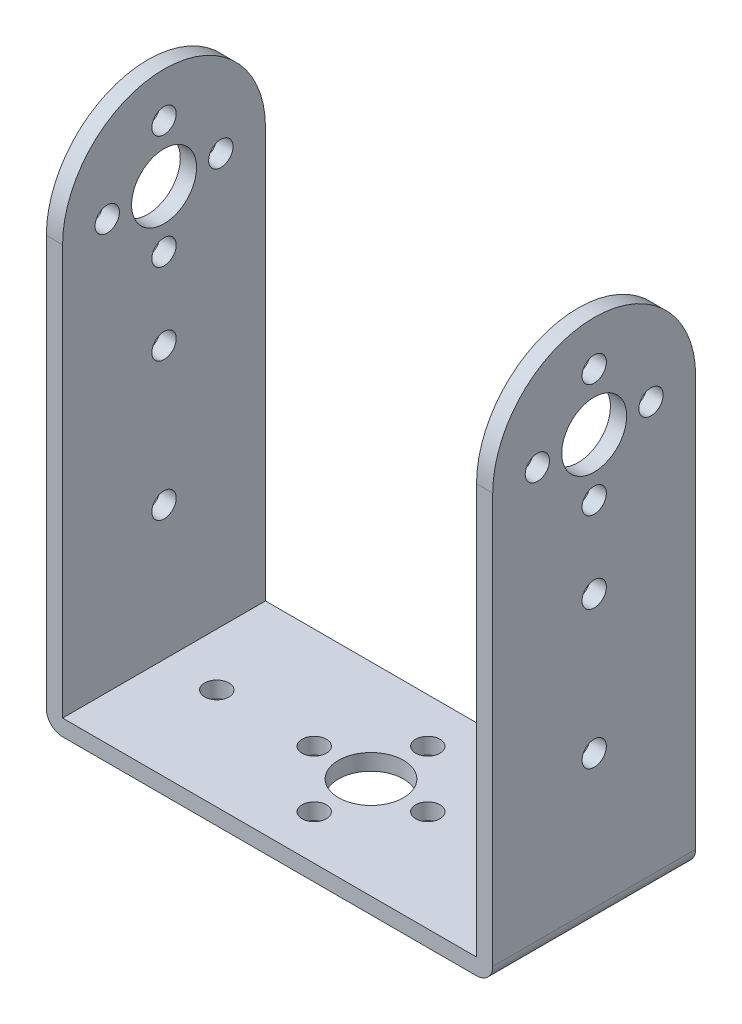
ISO-10303-21;
HEADER;
FILE_DESCRIPTION(('STEP AP214'),'2;1');
FILE_NAME('part.step','',(''),(''),'','','');
FILE_SCHEMA(('AUTOMOTIVE_DESIGN { 1 0 10303 214 1 1 1 1 }'));
ENDSEC;
DATA;
#1=APPLICATION_CONTEXT('core data for automotive mechanical design processes');
#2=APPLICATION_PROTOCOL_DEFINITION('international standard','automotive_design',2000,#1);
#3=PRODUCT_CONTEXT('',#1,'mechanical');
#4=PRODUCT('Part','Part','',(#3));
#5=PRODUCT_RELATED_PRODUCT_CATEGORY('part','',(#4));
#6=PRODUCT_DEFINITION_FORMATION('','',#4);
#7=PRODUCT_DEFINITION_CONTEXT('part definition',#1,'design');
#8=PRODUCT_DEFINITION('design','',#6,#7);
#9=PRODUCT_DEFINITION_SHAPE('','',#8);
#10=(LENGTH_UNIT() NAMED_UNIT(*) SI_UNIT(.MILLI.,.METRE.));
#11=(NAMED_UNIT(*) PLANE_ANGLE_UNIT() SI_UNIT($,.RADIAN.));
#12=(NAMED_UNIT(*) SI_UNIT($,.STERADIAN.) SOLID_ANGLE_UNIT());
#13=UNCERTAINTY_MEASURE_WITH_UNIT(LENGTH_MEASURE(1.E-05),#10,'distance_accuracy_value','');
#14=(GEOMETRIC_REPRESENTATION_CONTEXT(3) GLOBAL_UNCERTAINTY_ASSIGNED_CONTEXT((#13)) GLOBAL_UNIT_ASSIGNED_CONTEXT((#10,
#11,#12)) REPRESENTATION_CONTEXT('',''));
#15=CARTESIAN_POINT('',(0.,0.,0.));
#16=DIRECTION('',(0.,0.,1.));
#17=DIRECTION('',(1.,0.,0.));
#18=AXIS2_PLACEMENT_3D('',#15,#16,#17);
#19=CARTESIAN_POINT('',(-48.7225202501066,30.4955947136564,25.));
#20=DIRECTION('',(1.,0.,0.));
#21=DIRECTION('',(0.,1.,0.));
#22=AXIS2_PLACEMENT_3D('',#19,#20,#21);
#23=PLANE('',#22);
#24=CARTESIAN_POINT('',(-48.7225202501066,17.9955947136564,19.5));
#25=DIRECTION('',(1.,0.,0.));
#26=DIRECTION('',(0.,1.,0.));
#27=AXIS2_PLACEMENT_3D('',#24,#25,#26);
#28=CIRCLE('',#27,1.5);
#29=CARTESIAN_POINT('',(-48.7225202501066,19.4955947136564,19.5));
#30=VERTEX_POINT('',#29);
#31=EDGE_CURVE('E255',#30,#30,#28,.T.);
#32=ORIENTED_EDGE('',*,*,#31,.T.);
#33=EDGE_LOOP('',(#32));
#34=FACE_BOUND('',#33,.T.);
#35=CARTESIAN_POINT('',(-48.7225202501066,10.9955947136564,12.5));
#36=DIRECTION('',(1.,0.,0.));
#37=DIRECTION('',(0.,1.,0.));
#38=AXIS2_PLACEMENT_3D('',#35,#36,#37);
#39=CIRCLE('',#38,1.5);
#40=CARTESIAN_POINT('',(-48.7225202501066,12.4955947136564,12.5));
#41=VERTEX_POINT('',#40);
#42=EDGE_CURVE('E515',#41,#41,#39,.T.);
#43=ORIENTED_EDGE('',*,*,#42,.T.);
#44=EDGE_LOOP('',(#43));
#45=FACE_BOUND('',#44,.T.);
#46=CARTESIAN_POINT('',(-48.7225202501066,17.9955947136564,5.50000000000001));
#47=DIRECTION('',(1.,0.,0.));
#48=DIRECTION('',(0.,1.,0.));
#49=AXIS2_PLACEMENT_3D('',#46,#47,#48);
#50=CIRCLE('',#49,1.5);
#51=CARTESIAN_POINT('',(-48.7225202501066,19.4955947136564,5.50000000000001));
#52=VERTEX_POINT('',#51);
#53=EDGE_CURVE('E510',#52,#52,#50,.T.);
#54=ORIENTED_EDGE('',*,*,#53,.T.);
#55=EDGE_LOOP('',(#54));
#56=FACE_BOUND('',#55,.T.);
#57=CARTESIAN_POINT('',(-48.7225202501066,24.9955947136564,12.5));
#58=DIRECTION('',(1.,0.,0.));
#59=DIRECTION('',(0.,1.,0.));
#60=AXIS2_PLACEMENT_3D('',#57,#58,#59);
#61=CIRCLE('',#60,1.5);
#62=CARTESIAN_POINT('',(-48.7225202501066,26.4955947136564,12.5));
#63=VERTEX_POINT('',#62);
#64=EDGE_CURVE('E514',#63,#63,#61,.T.);
#65=ORIENTED_EDGE('',*,*,#64,.T.);
#66=EDGE_LOOP('',(#65));
#67=FACE_BOUND('',#66,.T.);
#68=CARTESIAN_POINT('',(-48.7225202501066,17.9955947136564,12.5));
#69=DIRECTION('',(1.,0.,0.));
#70=DIRECTION('',(0.,1.,0.));
#71=AXIS2_PLACEMENT_3D('',#68,#69,#70);
#72=CIRCLE('',#71,4.);
#73=CARTESIAN_POINT('',(-48.7225202501066,21.9955947136564,12.5));
#74=VERTEX_POINT('',#73);
#75=EDGE_CURVE('E509',#74,#74,#72,.T.);
#76=ORIENTED_EDGE('',*,*,#75,.T.);
#77=EDGE_LOOP('',(#76));
#78=FACE_BOUND('',#77,.T.);
#79=CARTESIAN_POINT('',(-48.7225202501066,0.995594713656392,12.5));
#80=DIRECTION('',(1.,0.,0.));
#81=DIRECTION('',(0.,1.,0.));
#82=AXIS2_PLACEMENT_3D('',#79,#80,#81);
#83=CIRCLE('',#82,1.5);
#84=CARTESIAN_POINT('',(-48.7225202501066,2.49559471365639,12.5));
#85=VERTEX_POINT('',#84);
#86=EDGE_CURVE('E519',#85,#85,#83,.T.);
#87=ORIENTED_EDGE('',*,*,#86,.T.);
#88=EDGE_LOOP('',(#87));
#89=FACE_BOUND('',#88,.T.);
#90=CARTESIAN_POINT('',(-48.7225202501066,-16.0044052863436,12.5));
#91=DIRECTION('',(1.,0.,0.));
#92=DIRECTION('',(0.,1.,0.));
#93=AXIS2_PLACEMENT_3D('',#90,#91,#92);
#94=CIRCLE('',#93,1.5);
#95=CARTESIAN_POINT('',(-48.7225202501066,-14.5044052863436,12.5));
#96=VERTEX_POINT('',#95);
#97=EDGE_CURVE('E458',#96,#96,#94,.T.);
#98=ORIENTED_EDGE('',*,*,#97,.T.);
#99=EDGE_LOOP('',(#98));
#100=FACE_BOUND('',#99,.T.);
#101=DIRECTION('',(0.,-1.,0.));
#102=VECTOR('',#101,1.);
#103=CARTESIAN_POINT('',(-48.7225202501066,30.4955947136564,25.));
#104=LINE('',#103,#102);
#105=CARTESIAN_POINT('',(-48.7225202501066,17.9955947136564,25.));
#106=VERTEX_POINT('',#105);
#107=CARTESIAN_POINT('',(-48.7225202501066,-32.5044052863436,25.));
#108=VERTEX_POINT('',#107);
#109=EDGE_CURVE('E185',#106,#108,#104,.T.);
#110=ORIENTED_EDGE('',*,*,#109,.F.);
#111=CARTESIAN_POINT('',(-48.7225202501066,17.9955947136564,12.5));
#112=DIRECTION('',(1.,0.,0.));
#113=DIRECTION('',(0.,1.,0.));
#114=AXIS2_PLACEMENT_3D('',#111,#112,#113);
#115=CIRCLE('',#114,12.5);
#116=CARTESIAN_POINT('',(-48.7225202501066,17.9955947136564,0.));
#117=VERTEX_POINT('',#116);
#118=EDGE_CURVE('E153',#117,#106,#115,.T.);
#119=ORIENTED_EDGE('',*,*,#118,.F.);
#120=DIRECTION('',(0.,-1.,0.));
#121=VECTOR('',#120,1.);
#122=CARTESIAN_POINT('',(-48.7225202501066,30.4955947136564,0.));
#123=LINE('',#122,#121);
#124=CARTESIAN_POINT('',(-48.7225202501066,-32.5044052863436,0.));
#125=VERTEX_POINT('',#124);
#126=EDGE_CURVE('E166',#117,#125,#123,.T.);
#127=ORIENTED_EDGE('',*,*,#126,.T.);
#128=DIRECTION('',(0.,0.,-1.));
#129=VECTOR('',#128,1.);
#130=CARTESIAN_POINT('',(-48.7225202501066,-32.5044052863436,25.));
#131=LINE('',#130,#129);
#132=EDGE_CURVE('E241',#125,#108,#131,.F.);
#133=ORIENTED_EDGE('',*,*,#132,.T.);
#134=EDGE_LOOP('',(#110,#119,#127,#133));
#135=FACE_BOUND('',#134,.T.);
#136=ADVANCED_FACE('F78',(#34,#45,#56,#67,#78,#89,#100,#135),#23,.F.);
#137=CARTESIAN_POINT('',(6.27747974989341,-34.5044052863436,25.));
#138=DIRECTION('',(-1.,0.,0.));
#139=DIRECTION('',(0.,-1.,0.));
#140=AXIS2_PLACEMENT_3D('',#137,#138,#139);
#141=PLANE('',#140);
#142=CARTESIAN_POINT('',(6.27747974989341,17.9955947136564,19.5));
#143=DIRECTION('',(-1.,0.,0.));
#144=DIRECTION('',(0.,-1.,0.));
#145=AXIS2_PLACEMENT_3D('',#142,#143,#144);
#146=CIRCLE('',#145,1.5);
#147=CARTESIAN_POINT('',(6.27747974989341,16.4955947136564,19.5));
#148=VERTEX_POINT('',#147);
#149=EDGE_CURVE('E307',#148,#148,#146,.T.);
#150=ORIENTED_EDGE('',*,*,#149,.T.);
#151=EDGE_LOOP('',(#150));
#152=FACE_BOUND('',#151,.T.);
#153=CARTESIAN_POINT('',(6.27747974989341,10.9955947136564,12.5));
#154=DIRECTION('',(-1.,0.,0.));
#155=DIRECTION('',(0.,-1.,0.));
#156=AXIS2_PLACEMENT_3D('',#153,#154,#155);
#157=CIRCLE('',#156,1.5);
#158=CARTESIAN_POINT('',(6.27747974989341,9.49559471365639,12.5));
#159=VERTEX_POINT('',#158);
#160=EDGE_CURVE('E289',#159,#159,#157,.T.);
#161=ORIENTED_EDGE('',*,*,#160,.T.);
#162=EDGE_LOOP('',(#161));
#163=FACE_BOUND('',#162,.T.);
#164=CARTESIAN_POINT('',(6.27747974989341,17.9955947136564,5.50000000000001));
#165=DIRECTION('',(-1.,0.,0.));
#166=DIRECTION('',(0.,-1.,0.));
#167=AXIS2_PLACEMENT_3D('',#164,#165,#166);
#168=CIRCLE('',#167,1.5);
#169=CARTESIAN_POINT('',(6.27747974989341,16.4955947136564,5.50000000000001));
#170=VERTEX_POINT('',#169);
#171=EDGE_CURVE('E283',#170,#170,#168,.T.);
#172=ORIENTED_EDGE('',*,*,#171,.T.);
#173=EDGE_LOOP('',(#172));
#174=FACE_BOUND('',#173,.T.);
#175=CARTESIAN_POINT('',(6.27747974989341,24.9955947136564,12.5));
#176=DIRECTION('',(-1.,0.,0.));
#177=DIRECTION('',(0.,-1.,0.));
#178=AXIS2_PLACEMENT_3D('',#175,#176,#177);
#179=CIRCLE('',#178,1.5);
#180=CARTESIAN_POINT('',(6.27747974989341,23.4955947136564,12.5));
#181=VERTEX_POINT('',#180);
#182=EDGE_CURVE('E278',#181,#181,#179,.T.);
#183=ORIENTED_EDGE('',*,*,#182,.T.);
#184=EDGE_LOOP('',(#183));
#185=FACE_BOUND('',#184,.T.);
#186=CARTESIAN_POINT('',(6.27747974989341,17.9955947136564,12.5));
#187=DIRECTION('',(-1.,0.,0.));
#188=DIRECTION('',(0.,-1.,0.));
#189=AXIS2_PLACEMENT_3D('',#186,#187,#188);
#190=CIRCLE('',#189,4.);
#191=CARTESIAN_POINT('',(6.27747974989341,13.9955947136564,12.5));
#192=VERTEX_POINT('',#191);
#193=EDGE_CURVE('E273',#192,#192,#190,.T.);
#194=ORIENTED_EDGE('',*,*,#193,.T.);
#195=EDGE_LOOP('',(#194));
#196=FACE_BOUND('',#195,.T.);
#197=CARTESIAN_POINT('',(6.27747974989341,0.995594713656386,12.5));
#198=DIRECTION('',(-1.,0.,0.));
#199=DIRECTION('',(0.,-1.,0.));
#200=AXIS2_PLACEMENT_3D('',#197,#198,#199);
#201=CIRCLE('',#200,1.5);
#202=CARTESIAN_POINT('',(6.27747974989341,-0.504405286343615,12.5));
#203=VERTEX_POINT('',#202);
#204=EDGE_CURVE('E267',#203,#203,#201,.T.);
#205=ORIENTED_EDGE('',*,*,#204,.T.);
#206=EDGE_LOOP('',(#205));
#207=FACE_BOUND('',#206,.T.);
#208=CARTESIAN_POINT('',(6.27747974989341,-16.0044052863436,12.5));
#209=DIRECTION('',(-1.,0.,0.));
#210=DIRECTION('',(0.,-1.,0.));
#211=AXIS2_PLACEMENT_3D('',#208,#209,#210);
#212=CIRCLE('',#211,1.5);
#213=CARTESIAN_POINT('',(6.27747974989341,-17.5044052863436,12.5));
#214=VERTEX_POINT('',#213);
#215=EDGE_CURVE('E261',#214,#214,#212,.T.);
#216=ORIENTED_EDGE('',*,*,#215,.T.);
#217=EDGE_LOOP('',(#216));
#218=FACE_BOUND('',#217,.T.);
#219=CARTESIAN_POINT('',(6.27747974989341,17.9955947136564,12.5));
#220=DIRECTION('',(1.,0.,0.));
#221=DIRECTION('',(0.,1.,0.));
#222=AXIS2_PLACEMENT_3D('',#219,#220,#221);
#223=CIRCLE('',#222,12.5);
#224=CARTESIAN_POINT('',(6.27747974989341,17.9955947136564,0.));
#225=VERTEX_POINT('',#224);
#226=CARTESIAN_POINT('',(6.27747974989341,17.9955947136564,25.));
#227=VERTEX_POINT('',#226);
#228=EDGE_CURVE('E96',#225,#227,#223,.T.);
#229=ORIENTED_EDGE('',*,*,#228,.T.);
#230=DIRECTION('',(0.,1.,0.));
#231=VECTOR('',#230,1.);
#232=CARTESIAN_POINT('',(6.27747974989341,-34.5044052863436,25.));
#233=LINE('',#232,#231);
#234=CARTESIAN_POINT('',(6.27747974989341,-32.5044052863436,25.));
#235=VERTEX_POINT('',#234);
#236=EDGE_CURVE('E161',#235,#227,#233,.T.);
#237=ORIENTED_EDGE('',*,*,#236,.F.);
#238=DIRECTION('',(0.,0.,-1.));
#239=VECTOR('',#238,1.);
#240=CARTESIAN_POINT('',(6.27747974989341,-32.5044052863436,25.));
#241=LINE('',#240,#239);
#242=CARTESIAN_POINT('',(6.27747974989341,-32.5044052863436,0.));
#243=VERTEX_POINT('',#242);
#244=EDGE_CURVE('E220',#235,#243,#241,.T.);
#245=ORIENTED_EDGE('',*,*,#244,.T.);
#246=DIRECTION('',(0.,1.,0.));
#247=VECTOR('',#246,1.);
#248=CARTESIAN_POINT('',(6.27747974989341,-34.5044052863436,0.));
#249=LINE('',#248,#247);
#250=EDGE_CURVE('E164',#243,#225,#249,.T.);
#251=ORIENTED_EDGE('',*,*,#250,.T.);
#252=EDGE_LOOP('',(#229,#237,#245,#251));
#253=FACE_BOUND('',#252,.T.);
#254=ADVANCED_FACE('F158',(#152,#163,#174,#185,#196,#207,#218,#253),#141,.F.);
#255=CARTESIAN_POINT('',(4.2774797498934,30.4955947136564,25.));
#256=DIRECTION('',(1.,0.,0.));
#257=DIRECTION('',(0.,1.,0.));
#258=AXIS2_PLACEMENT_3D('',#255,#256,#257);
#259=PLANE('',#258);
#260=CARTESIAN_POINT('',(4.2774797498934,17.9955947136564,19.5));
#261=DIRECTION('',(1.,0.,0.));
#262=DIRECTION('',(0.,1.,0.));
#263=AXIS2_PLACEMENT_3D('',#260,#261,#262);
#264=CIRCLE('',#263,1.5);
#265=CARTESIAN_POINT('',(4.2774797498934,19.4955947136564,19.5));
#266=VERTEX_POINT('',#265);
#267=EDGE_CURVE('E303',#266,#266,#264,.T.);
#268=ORIENTED_EDGE('',*,*,#267,.T.);
#269=EDGE_LOOP('',(#268));
#270=FACE_BOUND('',#269,.T.);
#271=CARTESIAN_POINT('',(4.2774797498934,10.9955947136564,12.5));
#272=DIRECTION('',(1.,0.,0.));
#273=DIRECTION('',(0.,1.,0.));
#274=AXIS2_PLACEMENT_3D('',#271,#272,#273);
#275=CIRCLE('',#274,1.5);
#276=CARTESIAN_POINT('',(4.2774797498934,12.4955947136564,12.5));
#277=VERTEX_POINT('',#276);
#278=EDGE_CURVE('E282',#277,#277,#275,.T.);
#279=ORIENTED_EDGE('',*,*,#278,.T.);
#280=EDGE_LOOP('',(#279));
#281=FACE_BOUND('',#280,.T.);
#282=CARTESIAN_POINT('',(4.2774797498934,17.9955947136564,5.50000000000001));
#283=DIRECTION('',(1.,0.,0.));
#284=DIRECTION('',(0.,1.,0.));
#285=AXIS2_PLACEMENT_3D('',#282,#283,#284);
#286=CIRCLE('',#285,1.5);
#287=CARTESIAN_POINT('',(4.2774797498934,19.4955947136564,5.50000000000001));
#288=VERTEX_POINT('',#287);
#289=EDGE_CURVE('E277',#288,#288,#286,.T.);
#290=ORIENTED_EDGE('',*,*,#289,.T.);
#291=EDGE_LOOP('',(#290));
#292=FACE_BOUND('',#291,.T.);
#293=CARTESIAN_POINT('',(4.2774797498934,24.9955947136564,12.5));
#294=DIRECTION('',(1.,0.,0.));
#295=DIRECTION('',(0.,1.,0.));
#296=AXIS2_PLACEMENT_3D('',#293,#294,#295);
#297=CIRCLE('',#296,1.5);
#298=CARTESIAN_POINT('',(4.2774797498934,26.4955947136564,12.5));
#299=VERTEX_POINT('',#298);
#300=EDGE_CURVE('E272',#299,#299,#297,.T.);
#301=ORIENTED_EDGE('',*,*,#300,.T.);
#302=EDGE_LOOP('',(#301));
#303=FACE_BOUND('',#302,.T.);
#304=CARTESIAN_POINT('',(4.2774797498934,17.9955947136564,12.5));
#305=DIRECTION('',(1.,0.,0.));
#306=DIRECTION('',(0.,1.,0.));
#307=AXIS2_PLACEMENT_3D('',#304,#305,#306);
#308=CIRCLE('',#307,4.);
#309=CARTESIAN_POINT('',(4.2774797498934,21.9955947136564,12.5));
#310=VERTEX_POINT('',#309);
#311=EDGE_CURVE('E266',#310,#310,#308,.T.);
#312=ORIENTED_EDGE('',*,*,#311,.T.);
#313=EDGE_LOOP('',(#312));
#314=FACE_BOUND('',#313,.T.);
#315=CARTESIAN_POINT('',(4.27747974989341,0.995594713656386,12.5));
#316=DIRECTION('',(1.,0.,0.));
#317=DIRECTION('',(0.,1.,0.));
#318=AXIS2_PLACEMENT_3D('',#315,#316,#317);
#319=CIRCLE('',#318,1.5);
#320=CARTESIAN_POINT('',(4.27747974989341,2.49559471365639,12.5));
#321=VERTEX_POINT('',#320);
#322=EDGE_CURVE('E260',#321,#321,#319,.T.);
#323=ORIENTED_EDGE('',*,*,#322,.T.);
#324=EDGE_LOOP('',(#323));
#325=FACE_BOUND('',#324,.T.);
#326=CARTESIAN_POINT('',(4.27747974989341,-16.0044052863436,12.5));
#327=DIRECTION('',(1.,0.,0.));
#328=DIRECTION('',(0.,1.,0.));
#329=AXIS2_PLACEMENT_3D('',#326,#327,#328);
#330=CIRCLE('',#329,1.5);
#331=CARTESIAN_POINT('',(4.27747974989341,-14.5044052863436,12.5));
#332=VERTEX_POINT('',#331);
#333=EDGE_CURVE('E254',#332,#332,#330,.T.);
#334=ORIENTED_EDGE('',*,*,#333,.T.);
#335=EDGE_LOOP('',(#334));
#336=FACE_BOUND('',#335,.T.);
#337=DIRECTION('',(0.,-1.,0.));
#338=VECTOR('',#337,1.);
#339=CARTESIAN_POINT('',(4.2774797498934,30.4955947136564,25.));
#340=LINE('',#339,#338);
#341=CARTESIAN_POINT('',(4.27747974989341,17.9955947136564,25.));
#342=VERTEX_POINT('',#341);
#343=CARTESIAN_POINT('',(4.27747974989341,-32.5044052863436,25.));
#344=VERTEX_POINT('',#343);
#345=EDGE_CURVE('E178',#342,#344,#340,.T.);
#346=ORIENTED_EDGE('',*,*,#345,.F.);
#347=CARTESIAN_POINT('',(4.2774797498934,17.9955947136564,12.5));
#348=DIRECTION('',(1.,0.,0.));
#349=DIRECTION('',(0.,1.,0.));
#350=AXIS2_PLACEMENT_3D('',#347,#348,#349);
#351=CIRCLE('',#350,12.5);
#352=CARTESIAN_POINT('',(4.27747974989341,17.9955947136564,0.));
#353=VERTEX_POINT('',#352);
#354=EDGE_CURVE('E167',#353,#342,#351,.T.);
#355=ORIENTED_EDGE('',*,*,#354,.F.);
#356=DIRECTION('',(0.,-1.,0.));
#357=VECTOR('',#356,1.);
#358=CARTESIAN_POINT('',(4.2774797498934,30.4955947136564,0.));
#359=LINE('',#358,#357);
#360=CARTESIAN_POINT('',(4.27747974989341,-32.5044052863436,0.));
#361=VERTEX_POINT('',#360);
#362=EDGE_CURVE('E203',#353,#361,#359,.T.);
#363=ORIENTED_EDGE('',*,*,#362,.T.);
#364=DIRECTION('',(0.,0.,-1.));
#365=VECTOR('',#364,1.);
#366=CARTESIAN_POINT('',(4.27747974989341,-32.5044052863436,25.));
#367=LINE('',#366,#365);
#368=EDGE_CURVE('E216',#344,#361,#367,.T.);
#369=ORIENTED_EDGE('',*,*,#368,.F.);
#370=EDGE_LOOP('',(#346,#355,#363,#369));
#371=FACE_BOUND('',#370,.T.);
#372=ADVANCED_FACE('F357',(#270,#281,#292,#303,#314,#325,#336,#371),#259,.F.);
#373=CARTESIAN_POINT('',(-46.7225202501066,-32.5044052863436,25.));
#374=DIRECTION('',(-1.,0.,0.));
#375=DIRECTION('',(0.,-1.,0.));
#376=AXIS2_PLACEMENT_3D('',#373,#374,#375);
#377=PLANE('',#376);
#378=CARTESIAN_POINT('',(-46.7225202501066,17.9955947136564,19.5));
#379=DIRECTION('',(-1.,0.,0.));
#380=DIRECTION('',(0.,-1.,0.));
#381=AXIS2_PLACEMENT_3D('',#378,#379,#380);
#382=CIRCLE('',#381,1.5);
#383=CARTESIAN_POINT('',(-46.7225202501066,16.4955947136564,19.5));
#384=VERTEX_POINT('',#383);
#385=EDGE_CURVE('E82',#384,#384,#382,.T.);
#386=ORIENTED_EDGE('',*,*,#385,.T.);
#387=EDGE_LOOP('',(#386));
#388=FACE_BOUND('',#387,.T.);
#389=CARTESIAN_POINT('',(-46.7225202501066,10.9955947136564,12.5));
#390=DIRECTION('',(-1.,0.,0.));
#391=DIRECTION('',(0.,-1.,0.));
#392=AXIS2_PLACEMENT_3D('',#389,#390,#391);
#393=CIRCLE('',#392,1.5);
#394=CARTESIAN_POINT('',(-46.7225202501066,9.49559471365639,12.5));
#395=VERTEX_POINT('',#394);
#396=EDGE_CURVE('E279',#395,#395,#393,.T.);
#397=ORIENTED_EDGE('',*,*,#396,.T.);
#398=EDGE_LOOP('',(#397));
#399=FACE_BOUND('',#398,.T.);
#400=CARTESIAN_POINT('',(-46.7225202501066,17.9955947136564,5.50000000000001));
#401=DIRECTION('',(-1.,0.,0.));
#402=DIRECTION('',(0.,-1.,0.));
#403=AXIS2_PLACEMENT_3D('',#400,#401,#402);
#404=CIRCLE('',#403,1.5);
#405=CARTESIAN_POINT('',(-46.7225202501066,16.4955947136564,5.50000000000001));
#406=VERTEX_POINT('',#405);
#407=EDGE_CURVE('E274',#406,#406,#404,.T.);
#408=ORIENTED_EDGE('',*,*,#407,.T.);
#409=EDGE_LOOP('',(#408));
#410=FACE_BOUND('',#409,.T.);
#411=CARTESIAN_POINT('',(-46.7225202501066,24.9955947136564,12.5));
#412=DIRECTION('',(-1.,0.,0.));
#413=DIRECTION('',(0.,-1.,0.));
#414=AXIS2_PLACEMENT_3D('',#411,#412,#413);
#415=CIRCLE('',#414,1.5);
#416=CARTESIAN_POINT('',(-46.7225202501066,23.4955947136564,12.5));
#417=VERTEX_POINT('',#416);
#418=EDGE_CURVE('E268',#417,#417,#415,.T.);
#419=ORIENTED_EDGE('',*,*,#418,.T.);
#420=EDGE_LOOP('',(#419));
#421=FACE_BOUND('',#420,.T.);
#422=CARTESIAN_POINT('',(-46.7225202501066,17.9955947136564,12.5));
#423=DIRECTION('',(-1.,0.,0.));
#424=DIRECTION('',(0.,-1.,0.));
#425=AXIS2_PLACEMENT_3D('',#422,#423,#424);
#426=CIRCLE('',#425,4.);
#427=CARTESIAN_POINT('',(-46.7225202501066,13.9955947136564,12.5));
#428=VERTEX_POINT('',#427);
#429=EDGE_CURVE('E262',#428,#428,#426,.T.);
#430=ORIENTED_EDGE('',*,*,#429,.T.);
#431=EDGE_LOOP('',(#430));
#432=FACE_BOUND('',#431,.T.);
#433=CARTESIAN_POINT('',(-46.7225202501066,0.995594713656391,12.5));
#434=DIRECTION('',(-1.,0.,0.));
#435=DIRECTION('',(0.,-1.,0.));
#436=AXIS2_PLACEMENT_3D('',#433,#434,#435);
#437=CIRCLE('',#436,1.5);
#438=CARTESIAN_POINT('',(-46.7225202501066,-0.504405286343609,12.5));
#439=VERTEX_POINT('',#438);
#440=EDGE_CURVE('E256',#439,#439,#437,.T.);
#441=ORIENTED_EDGE('',*,*,#440,.T.);
#442=EDGE_LOOP('',(#441));
#443=FACE_BOUND('',#442,.T.);
#444=CARTESIAN_POINT('',(-46.7225202501066,-16.0044052863436,12.5));
#445=DIRECTION('',(-1.,0.,0.));
#446=DIRECTION('',(0.,-1.,0.));
#447=AXIS2_PLACEMENT_3D('',#444,#445,#446);
#448=CIRCLE('',#447,1.5);
#449=CARTESIAN_POINT('',(-46.7225202501066,-17.5044052863436,12.5));
#450=VERTEX_POINT('',#449);
#451=EDGE_CURVE('E250',#450,#450,#448,.T.);
#452=ORIENTED_EDGE('',*,*,#451,.T.);
#453=EDGE_LOOP('',(#452));
#454=FACE_BOUND('',#453,.T.);
#455=CARTESIAN_POINT('',(-46.7225202501066,17.9955947136564,12.5));
#456=DIRECTION('',(-1.,0.,0.));
#457=DIRECTION('',(0.,-1.,0.));
#458=AXIS2_PLACEMENT_3D('',#455,#456,#457);
#459=CIRCLE('',#458,12.5);
#460=CARTESIAN_POINT('',(-46.7225202501066,17.9955947136564,25.));
#461=VERTEX_POINT('',#460);
#462=CARTESIAN_POINT('',(-46.7225202501066,17.9955947136564,0.));
#463=VERTEX_POINT('',#462);
#464=EDGE_CURVE('E322',#461,#463,#459,.T.);
#465=ORIENTED_EDGE('',*,*,#464,.F.);
#466=DIRECTION('',(0.,1.,0.));
#467=VECTOR('',#466,1.);
#468=CARTESIAN_POINT('',(-46.7225202501066,-32.5044052863436,25.));
#469=LINE('',#468,#467);
#470=CARTESIAN_POINT('',(-46.7225202501066,-32.5044052863436,25.));
#471=VERTEX_POINT('',#470);
#472=EDGE_CURVE('E191',#471,#461,#469,.T.);
#473=ORIENTED_EDGE('',*,*,#472,.F.);
#474=DIRECTION('',(0.,0.,-1.));
#475=VECTOR('',#474,1.);
#476=CARTESIAN_POINT('',(-46.7225202501066,-32.5044052863436,25.));
#477=LINE('',#476,#475);
#478=CARTESIAN_POINT('',(-46.7225202501066,-32.5044052863436,0.));
#479=VERTEX_POINT('',#478);
#480=EDGE_CURVE('E195',#471,#479,#477,.T.);
#481=ORIENTED_EDGE('',*,*,#480,.T.);
#482=DIRECTION('',(0.,1.,0.));
#483=VECTOR('',#482,1.);
#484=CARTESIAN_POINT('',(-46.7225202501066,-32.5044052863436,0.));
#485=LINE('',#484,#483);
#486=EDGE_CURVE('E209',#479,#463,#485,.T.);
#487=ORIENTED_EDGE('',*,*,#486,.T.);
#488=EDGE_LOOP('',(#465,#473,#481,#487));
#489=FACE_BOUND('',#488,.T.);
#490=ADVANCED_FACE('F365',(#388,#399,#410,#421,#432,#443,#454,#489),#377,.F.);
#491=CARTESIAN_POINT('',(-48.7225202501066,-34.5044052863436,25.));
#492=DIRECTION('',(0.,1.,0.));
#493=DIRECTION('',(0.,0.,1.));
#494=AXIS2_PLACEMENT_3D('',#491,#492,#493);
#495=PLANE('',#494);
#496=CARTESIAN_POINT('',(-40.2225202501066,-34.5044052863436,12.5));
#497=DIRECTION('',(0.,1.,0.));
#498=DIRECTION('',(-1.,0.,0.));
#499=AXIS2_PLACEMENT_3D('',#496,#497,#498);
#500=CIRCLE('',#499,1.5);
#501=CARTESIAN_POINT('',(-41.7225202501066,-34.5044052863436,12.5));
#502=VERTEX_POINT('',#501);
#503=EDGE_CURVE('E449',#502,#502,#500,.T.);
#504=ORIENTED_EDGE('',*,*,#503,.T.);
#505=EDGE_LOOP('',(#504));
#506=FACE_BOUND('',#505,.T.);
#507=CARTESIAN_POINT('',(-2.22252025010659,-34.5044052863436,12.5));
#508=DIRECTION('',(0.,1.,0.));
#509=DIRECTION('',(-1.,0.,0.));
#510=AXIS2_PLACEMENT_3D('',#507,#508,#509);
#511=CIRCLE('',#510,1.5);
#512=CARTESIAN_POINT('',(-3.72252025010659,-34.5044052863436,12.5));
#513=VERTEX_POINT('',#512);
#514=EDGE_CURVE('E477',#513,#513,#511,.T.);
#515=ORIENTED_EDGE('',*,*,#514,.T.);
#516=EDGE_LOOP('',(#515));
#517=FACE_BOUND('',#516,.T.);
#518=CARTESIAN_POINT('',(-21.2225202501066,-34.5044052863436,19.5));
#519=DIRECTION('',(0.,1.,0.));
#520=DIRECTION('',(-1.,0.,0.));
#521=AXIS2_PLACEMENT_3D('',#518,#519,#520);
#522=CIRCLE('',#521,1.5);
#523=CARTESIAN_POINT('',(-22.7225202501066,-34.5044052863436,19.5));
#524=VERTEX_POINT('',#523);
#525=EDGE_CURVE('E469',#524,#524,#522,.T.);
#526=ORIENTED_EDGE('',*,*,#525,.T.);
#527=EDGE_LOOP('',(#526));
#528=FACE_BOUND('',#527,.T.);
#529=CARTESIAN_POINT('',(-28.2225202501066,-34.5044052863436,12.5));
#530=DIRECTION('',(0.,1.,0.));
#531=DIRECTION('',(-1.,0.,0.));
#532=AXIS2_PLACEMENT_3D('',#529,#530,#531);
#533=CIRCLE('',#532,1.5);
#534=CARTESIAN_POINT('',(-29.7225202501066,-34.5044052863436,12.5));
#535=VERTEX_POINT('',#534);
#536=EDGE_CURVE('E461',#535,#535,#533,.T.);
#537=ORIENTED_EDGE('',*,*,#536,.T.);
#538=EDGE_LOOP('',(#537));
#539=FACE_BOUND('',#538,.T.);
#540=CARTESIAN_POINT('',(-21.2225202501066,-34.5044052863436,12.5));
#541=DIRECTION('',(0.,1.,0.));
#542=DIRECTION('',(-1.,0.,0.));
#543=AXIS2_PLACEMENT_3D('',#540,#541,#542);
#544=CIRCLE('',#543,4.);
#545=CARTESIAN_POINT('',(-25.2225202501066,-34.5044052863436,12.5));
#546=VERTEX_POINT('',#545);
#547=EDGE_CURVE('E485',#546,#546,#544,.T.);
#548=ORIENTED_EDGE('',*,*,#547,.T.);
#549=EDGE_LOOP('',(#548));
#550=FACE_BOUND('',#549,.T.);
#551=CARTESIAN_POINT('',(-14.2225202501066,-34.5044052863436,12.5));
#552=DIRECTION('',(0.,1.,0.));
#553=DIRECTION('',(-1.,0.,0.));
#554=AXIS2_PLACEMENT_3D('',#551,#552,#553);
#555=CIRCLE('',#554,1.5);
#556=CARTESIAN_POINT('',(-15.7225202501066,-34.5044052863436,12.5));
#557=VERTEX_POINT('',#556);
#558=EDGE_CURVE('E486',#557,#557,#555,.T.);
#559=ORIENTED_EDGE('',*,*,#558,.T.);
#560=EDGE_LOOP('',(#559));
#561=FACE_BOUND('',#560,.T.);
#562=CARTESIAN_POINT('',(-21.2225202501066,-34.5044052863436,5.5));
#563=DIRECTION('',(0.,1.,0.));
#564=DIRECTION('',(-1.,0.,0.));
#565=AXIS2_PLACEMENT_3D('',#562,#563,#564);
#566=CIRCLE('',#565,1.5);
#567=CARTESIAN_POINT('',(-22.7225202501066,-34.5044052863436,5.5));
#568=VERTEX_POINT('',#567);
#569=EDGE_CURVE('E468',#568,#568,#566,.T.);
#570=ORIENTED_EDGE('',*,*,#569,.T.);
#571=EDGE_LOOP('',(#570));
#572=FACE_BOUND('',#571,.T.);
#573=DIRECTION('',(1.,0.,0.));
#574=VECTOR('',#573,1.);
#575=CARTESIAN_POINT('',(-48.7225202501066,-34.5044052863436,25.));
#576=LINE('',#575,#574);
#577=CARTESIAN_POINT('',(-46.7225202501066,-34.5044052863436,25.));
#578=VERTEX_POINT('',#577);
#579=CARTESIAN_POINT('',(4.2774797498934,-34.5044052863436,25.));
#580=VERTEX_POINT('',#579);
#581=EDGE_CURVE('E179',#578,#580,#576,.T.);
#582=ORIENTED_EDGE('',*,*,#581,.F.);
#583=DIRECTION('',(0.,0.,-1.));
#584=VECTOR('',#583,1.);
#585=CARTESIAN_POINT('',(-46.7225202501066,-34.5044052863436,25.));
#586=LINE('',#585,#584);
#587=CARTESIAN_POINT('',(-46.7225202501066,-34.5044052863436,0.));
#588=VERTEX_POINT('',#587);
#589=EDGE_CURVE('E233',#578,#588,#586,.T.);
#590=ORIENTED_EDGE('',*,*,#589,.T.);
#591=DIRECTION('',(1.,0.,0.));
#592=VECTOR('',#591,1.);
#593=CARTESIAN_POINT('',(-48.7225202501066,-34.5044052863436,0.));
#594=LINE('',#593,#592);
#595=CARTESIAN_POINT('',(4.2774797498934,-34.5044052863436,0.));
#596=VERTEX_POINT('',#595);
#597=EDGE_CURVE('E198',#588,#596,#594,.T.);
#598=ORIENTED_EDGE('',*,*,#597,.T.);
#599=DIRECTION('',(0.,0.,-1.));
#600=VECTOR('',#599,1.);
#601=CARTESIAN_POINT('',(4.2774797498934,-34.5044052863436,25.));
#602=LINE('',#601,#600);
#603=EDGE_CURVE('E227',#596,#580,#602,.F.);
#604=ORIENTED_EDGE('',*,*,#603,.T.);
#605=EDGE_LOOP('',(#582,#590,#598,#604));
#606=FACE_BOUND('',#605,.T.);
#607=ADVANCED_FACE('F339',(#506,#517,#528,#539,#550,#561,#572,#606),#495,.F.);
#608=CARTESIAN_POINT('',(4.27747974989341,-32.5044052863436,25.));
#609=DIRECTION('',(0.,-1.,0.));
#610=DIRECTION('',(1.,0.,0.));
#611=AXIS2_PLACEMENT_3D('',#608,#609,#610);
#612=PLANE('',#611);
#613=CARTESIAN_POINT('',(-40.2225202501066,-32.5044052863436,12.5));
#614=DIRECTION('',(0.,1.,0.));
#615=DIRECTION('',(-1.,0.,0.));
#616=AXIS2_PLACEMENT_3D('',#613,#614,#615);
#617=CIRCLE('',#616,1.5);
#618=CARTESIAN_POINT('',(-41.7225202501066,-32.5044052863436,12.5));
#619=VERTEX_POINT('',#618);
#620=EDGE_CURVE('E452',#619,#619,#617,.T.);
#621=ORIENTED_EDGE('',*,*,#620,.F.);
#622=EDGE_LOOP('',(#621));
#623=FACE_BOUND('',#622,.T.);
#624=CARTESIAN_POINT('',(-2.22252025010659,-32.5044052863436,12.5));
#625=DIRECTION('',(0.,1.,0.));
#626=DIRECTION('',(-1.,0.,0.));
#627=AXIS2_PLACEMENT_3D('',#624,#625,#626);
#628=CIRCLE('',#627,1.5);
#629=CARTESIAN_POINT('',(-3.72252025010659,-32.5044052863436,12.5));
#630=VERTEX_POINT('',#629);
#631=EDGE_CURVE('E473',#630,#630,#628,.T.);
#632=ORIENTED_EDGE('',*,*,#631,.F.);
#633=EDGE_LOOP('',(#632));
#634=FACE_BOUND('',#633,.T.);
#635=CARTESIAN_POINT('',(-21.2225202501066,-32.5044052863436,19.5));
#636=DIRECTION('',(0.,1.,0.));
#637=DIRECTION('',(-1.,0.,0.));
#638=AXIS2_PLACEMENT_3D('',#635,#636,#637);
#639=CIRCLE('',#638,1.5);
#640=CARTESIAN_POINT('',(-22.7225202501066,-32.5044052863436,19.5));
#641=VERTEX_POINT('',#640);
#642=EDGE_CURVE('E464',#641,#641,#639,.T.);
#643=ORIENTED_EDGE('',*,*,#642,.F.);
#644=EDGE_LOOP('',(#643));
#645=FACE_BOUND('',#644,.T.);
#646=CARTESIAN_POINT('',(-28.2225202501066,-32.5044052863436,12.5));
#647=DIRECTION('',(0.,1.,0.));
#648=DIRECTION('',(-1.,0.,0.));
#649=AXIS2_PLACEMENT_3D('',#646,#647,#648);
#650=CIRCLE('',#649,1.5);
#651=CARTESIAN_POINT('',(-29.7225202501066,-32.5044052863436,12.5));
#652=VERTEX_POINT('',#651);
#653=EDGE_CURVE('E454',#652,#652,#650,.T.);
#654=ORIENTED_EDGE('',*,*,#653,.F.);
#655=EDGE_LOOP('',(#654));
#656=FACE_BOUND('',#655,.T.);
#657=CARTESIAN_POINT('',(-21.2225202501066,-32.5044052863436,12.5));
#658=DIRECTION('',(0.,1.,0.));
#659=DIRECTION('',(-1.,0.,0.));
#660=AXIS2_PLACEMENT_3D('',#657,#658,#659);
#661=CIRCLE('',#660,4.);
#662=CARTESIAN_POINT('',(-25.2225202501066,-32.5044052863436,12.5));
#663=VERTEX_POINT('',#662);
#664=EDGE_CURVE('E500',#663,#663,#661,.T.);
#665=ORIENTED_EDGE('',*,*,#664,.F.);
#666=EDGE_LOOP('',(#665));
#667=FACE_BOUND('',#666,.T.);
#668=CARTESIAN_POINT('',(-14.2225202501066,-32.5044052863436,12.5));
#669=DIRECTION('',(0.,1.,0.));
#670=DIRECTION('',(-1.,0.,0.));
#671=AXIS2_PLACEMENT_3D('',#668,#669,#670);
#672=CIRCLE('',#671,1.5);
#673=CARTESIAN_POINT('',(-15.7225202501066,-32.5044052863436,12.5));
#674=VERTEX_POINT('',#673);
#675=EDGE_CURVE('E481',#674,#674,#672,.T.);
#676=ORIENTED_EDGE('',*,*,#675,.F.);
#677=EDGE_LOOP('',(#676));
#678=FACE_BOUND('',#677,.T.);
#679=CARTESIAN_POINT('',(-21.2225202501066,-32.5044052863436,5.5));
#680=DIRECTION('',(0.,1.,0.));
#681=DIRECTION('',(-1.,0.,0.));
#682=AXIS2_PLACEMENT_3D('',#679,#680,#681);
#683=CIRCLE('',#682,1.5);
#684=CARTESIAN_POINT('',(-22.7225202501066,-32.5044052863436,5.5));
#685=VERTEX_POINT('',#684);
#686=EDGE_CURVE('E490',#685,#685,#683,.T.);
#687=ORIENTED_EDGE('',*,*,#686,.F.);
#688=EDGE_LOOP('',(#687));
#689=FACE_BOUND('',#688,.T.);
#690=DIRECTION('',(-1.,0.,0.));
#691=VECTOR('',#690,1.);
#692=CARTESIAN_POINT('',(4.27747974989341,-32.5044052863436,0.));
#693=LINE('',#692,#691);
#694=EDGE_CURVE('E206',#361,#479,#693,.T.);
#695=ORIENTED_EDGE('',*,*,#694,.T.);
#696=ORIENTED_EDGE('',*,*,#480,.F.);
#697=DIRECTION('',(-1.,0.,0.));
#698=VECTOR('',#697,1.);
#699=CARTESIAN_POINT('',(4.27747974989341,-32.5044052863436,25.));
#700=LINE('',#699,#698);
#701=EDGE_CURVE('E183',#344,#471,#700,.T.);
#702=ORIENTED_EDGE('',*,*,#701,.F.);
#703=ORIENTED_EDGE('',*,*,#368,.T.);
#704=EDGE_LOOP('',(#695,#696,#702,#703));
#705=FACE_BOUND('',#704,.T.);
#706=ADVANCED_FACE('F364',(#623,#634,#645,#656,#667,#678,#689,#705),#612,.F.);
#707=CARTESIAN_POINT('',(0.,0.,25.));
#708=DIRECTION('',(0.,0.,1.));
#709=DIRECTION('',(1.,0.,0.));
#710=AXIS2_PLACEMENT_3D('',#707,#708,#709);
#711=PLANE('',#710);
#712=DIRECTION('',(1.,0.,0.));
#713=VECTOR('',#712,1.);
#714=CARTESIAN_POINT('',(-48.7225202501066,17.9955947136564,25.));
#715=LINE('',#714,#713);
#716=EDGE_CURVE('E311',#106,#461,#715,.T.);
#717=ORIENTED_EDGE('',*,*,#716,.F.);
#718=ORIENTED_EDGE('',*,*,#109,.T.);
#719=CARTESIAN_POINT('',(-46.7225202501066,-32.5044052863436,25.));
#720=DIRECTION('',(0.,0.,1.));
#721=DIRECTION('',(1.,0.,0.));
#722=AXIS2_PLACEMENT_3D('',#719,#720,#721);
#723=CIRCLE('',#722,2.);
#724=EDGE_CURVE('E245',#108,#578,#723,.T.);
#725=ORIENTED_EDGE('',*,*,#724,.T.);
#726=ORIENTED_EDGE('',*,*,#581,.T.);
#727=CARTESIAN_POINT('',(4.27747974989341,-32.5044052863436,25.));
#728=DIRECTION('',(0.,0.,1.));
#729=DIRECTION('',(1.,0.,0.));
#730=AXIS2_PLACEMENT_3D('',#727,#728,#729);
#731=CIRCLE('',#730,2.);
#732=EDGE_CURVE('E176',#580,#235,#731,.T.);
#733=ORIENTED_EDGE('',*,*,#732,.T.);
#734=ORIENTED_EDGE('',*,*,#236,.T.);
#735=DIRECTION('',(1.,0.,0.));
#736=VECTOR('',#735,1.);
#737=CARTESIAN_POINT('',(-48.7225202501066,17.9955947136564,25.));
#738=LINE('',#737,#736);
#739=EDGE_CURVE('E12',#342,#227,#738,.T.);
#740=ORIENTED_EDGE('',*,*,#739,.F.);
#741=ORIENTED_EDGE('',*,*,#345,.T.);
#742=ORIENTED_EDGE('',*,*,#701,.T.);
#743=ORIENTED_EDGE('',*,*,#472,.T.);
#744=EDGE_LOOP('',(#717,#718,#725,#726,#733,#734,#740,#741,#742,#743));
#745=FACE_BOUND('',#744,.T.);
#746=ADVANCED_FACE('F174',(#745),#711,.T.);
#747=CARTESIAN_POINT('',(0.,0.,0.));
#748=DIRECTION('',(0.,0.,1.));
#749=DIRECTION('',(1.,0.,0.));
#750=AXIS2_PLACEMENT_3D('',#747,#748,#749);
#751=PLANE('',#750);
#752=ORIENTED_EDGE('',*,*,#126,.F.);
#753=DIRECTION('',(1.,0.,0.));
#754=VECTOR('',#753,1.);
#755=CARTESIAN_POINT('',(-48.7225202501066,17.9955947136564,0.));
#756=LINE('',#755,#754);
#757=EDGE_CURVE('E318',#117,#463,#756,.T.);
#758=ORIENTED_EDGE('',*,*,#757,.T.);
#759=ORIENTED_EDGE('',*,*,#486,.F.);
#760=ORIENTED_EDGE('',*,*,#694,.F.);
#761=ORIENTED_EDGE('',*,*,#362,.F.);
#762=DIRECTION('',(1.,0.,0.));
#763=VECTOR('',#762,1.);
#764=CARTESIAN_POINT('',(-48.7225202501066,17.9955947136564,0.));
#765=LINE('',#764,#763);
#766=EDGE_CURVE('E89',#353,#225,#765,.T.);
#767=ORIENTED_EDGE('',*,*,#766,.T.);
#768=ORIENTED_EDGE('',*,*,#250,.F.);
#769=CARTESIAN_POINT('',(4.27747974989341,-32.5044052863436,0.));
#770=DIRECTION('',(0.,0.,1.));
#771=DIRECTION('',(1.,0.,0.));
#772=AXIS2_PLACEMENT_3D('',#769,#770,#771);
#773=CIRCLE('',#772,2.);
#774=EDGE_CURVE('E223',#243,#596,#773,.F.);
#775=ORIENTED_EDGE('',*,*,#774,.T.);
#776=ORIENTED_EDGE('',*,*,#597,.F.);
#777=CARTESIAN_POINT('',(-46.7225202501066,-32.5044052863436,0.));
#778=DIRECTION('',(0.,0.,1.));
#779=DIRECTION('',(1.,0.,0.));
#780=AXIS2_PLACEMENT_3D('',#777,#778,#779);
#781=CIRCLE('',#780,2.);
#782=EDGE_CURVE('E237',#588,#125,#781,.F.);
#783=ORIENTED_EDGE('',*,*,#782,.T.);
#784=EDGE_LOOP('',(#752,#758,#759,#760,#761,#767,#768,#775,#776,#783));
#785=FACE_BOUND('',#784,.T.);
#786=ADVANCED_FACE('F341',(#785),#751,.F.);
#787=CARTESIAN_POINT('',(4.27747974989341,-32.5044052863436,25.));
#788=DIRECTION('',(0.,0.,-1.));
#789=DIRECTION('',(-1.,0.,0.));
#790=AXIS2_PLACEMENT_3D('',#787,#788,#789);
#791=CYLINDRICAL_SURFACE('',#790,2.);
#792=ORIENTED_EDGE('',*,*,#732,.F.);
#793=ORIENTED_EDGE('',*,*,#603,.F.);
#794=ORIENTED_EDGE('',*,*,#774,.F.);
#795=ORIENTED_EDGE('',*,*,#244,.F.);
#796=EDGE_LOOP('',(#792,#793,#794,#795));
#797=FACE_BOUND('',#796,.T.);
#798=ADVANCED_FACE('F344',(#797),#791,.T.);
#799=CARTESIAN_POINT('',(-46.7225202501066,-32.5044052863436,25.));
#800=DIRECTION('',(0.,0.,-1.));
#801=DIRECTION('',(-1.,0.,0.));
#802=AXIS2_PLACEMENT_3D('',#799,#800,#801);
#803=CYLINDRICAL_SURFACE('',#802,2.);
#804=ORIENTED_EDGE('',*,*,#724,.F.);
#805=ORIENTED_EDGE('',*,*,#132,.F.);
#806=ORIENTED_EDGE('',*,*,#782,.F.);
#807=ORIENTED_EDGE('',*,*,#589,.F.);
#808=EDGE_LOOP('',(#804,#805,#806,#807));
#809=FACE_BOUND('',#808,.T.);
#810=ADVANCED_FACE('F80',(#809),#803,.T.);
#811=CARTESIAN_POINT('',(-48.7225202501066,17.9955947136564,12.5));
#812=DIRECTION('',(1.,0.,0.));
#813=DIRECTION('',(0.,1.,0.));
#814=AXIS2_PLACEMENT_3D('',#811,#812,#813);
#815=CYLINDRICAL_SURFACE('',#814,12.5);
#816=ORIENTED_EDGE('',*,*,#228,.F.);
#817=ORIENTED_EDGE('',*,*,#766,.F.);
#818=ORIENTED_EDGE('',*,*,#354,.T.);
#819=ORIENTED_EDGE('',*,*,#739,.T.);
#820=EDGE_LOOP('',(#816,#817,#818,#819));
#821=FACE_BOUND('',#820,.T.);
#822=ADVANCED_FACE('F170',(#821),#815,.T.);
#823=ORIENTED_EDGE('',*,*,#464,.T.);
#824=ORIENTED_EDGE('',*,*,#757,.F.);
#825=ORIENTED_EDGE('',*,*,#118,.T.);
#826=ORIENTED_EDGE('',*,*,#716,.T.);
#827=EDGE_LOOP('',(#823,#824,#825,#826));
#828=FACE_BOUND('',#827,.T.);
#829=ADVANCED_FACE('F381',(#828),#815,.T.);
#830=CARTESIAN_POINT('',(-48.7225202501066,-16.0044052863436,12.5));
#831=DIRECTION('',(1.,0.,0.));
#832=DIRECTION('',(0.,1.,0.));
#833=AXIS2_PLACEMENT_3D('',#830,#831,#832);
#834=CYLINDRICAL_SURFACE('',#833,1.5);
#835=ORIENTED_EDGE('',*,*,#97,.F.);
#836=EDGE_LOOP('',(#835));
#837=FACE_BOUND('',#836,.T.);
#838=ORIENTED_EDGE('',*,*,#451,.F.);
#839=EDGE_LOOP('',(#838));
#840=FACE_BOUND('',#839,.T.);
#841=ADVANCED_FACE('F388',(#837,#840),#834,.F.);
#842=CARTESIAN_POINT('',(-48.7225202501066,0.995594713656392,12.5));
#843=DIRECTION('',(1.,0.,0.));
#844=DIRECTION('',(0.,1.,0.));
#845=AXIS2_PLACEMENT_3D('',#842,#843,#844);
#846=CYLINDRICAL_SURFACE('',#845,1.5);
#847=ORIENTED_EDGE('',*,*,#86,.F.);
#848=EDGE_LOOP('',(#847));
#849=FACE_BOUND('',#848,.T.);
#850=ORIENTED_EDGE('',*,*,#440,.F.);
#851=EDGE_LOOP('',(#850));
#852=FACE_BOUND('',#851,.T.);
#853=ADVANCED_FACE('F393',(#849,#852),#846,.F.);
#854=CARTESIAN_POINT('',(-48.7225202501066,17.9955947136564,12.5));
#855=DIRECTION('',(1.,0.,0.));
#856=DIRECTION('',(0.,1.,0.));
#857=AXIS2_PLACEMENT_3D('',#854,#855,#856);
#858=CYLINDRICAL_SURFACE('',#857,4.);
#859=ORIENTED_EDGE('',*,*,#75,.F.);
#860=EDGE_LOOP('',(#859));
#861=FACE_BOUND('',#860,.T.);
#862=ORIENTED_EDGE('',*,*,#429,.F.);
#863=EDGE_LOOP('',(#862));
#864=FACE_BOUND('',#863,.T.);
#865=ADVANCED_FACE('F403',(#861,#864),#858,.F.);
#866=CARTESIAN_POINT('',(-48.7225202501066,24.9955947136564,12.5));
#867=DIRECTION('',(1.,0.,0.));
#868=DIRECTION('',(0.,1.,0.));
#869=AXIS2_PLACEMENT_3D('',#866,#867,#868);
#870=CYLINDRICAL_SURFACE('',#869,1.5);
#871=ORIENTED_EDGE('',*,*,#64,.F.);
#872=EDGE_LOOP('',(#871));
#873=FACE_BOUND('',#872,.T.);
#874=ORIENTED_EDGE('',*,*,#418,.F.);
#875=EDGE_LOOP('',(#874));
#876=FACE_BOUND('',#875,.T.);
#877=ADVANCED_FACE('F399',(#873,#876),#870,.F.);
#878=CARTESIAN_POINT('',(-48.7225202501066,17.9955947136564,5.50000000000001));
#879=DIRECTION('',(1.,0.,0.));
#880=DIRECTION('',(0.,1.,0.));
#881=AXIS2_PLACEMENT_3D('',#878,#879,#880);
#882=CYLINDRICAL_SURFACE('',#881,1.5);
#883=ORIENTED_EDGE('',*,*,#53,.F.);
#884=EDGE_LOOP('',(#883));
#885=FACE_BOUND('',#884,.T.);
#886=ORIENTED_EDGE('',*,*,#407,.F.);
#887=EDGE_LOOP('',(#886));
#888=FACE_BOUND('',#887,.T.);
#889=ADVANCED_FACE('F413',(#885,#888),#882,.F.);
#890=CARTESIAN_POINT('',(-48.7225202501066,10.9955947136564,12.5));
#891=DIRECTION('',(1.,0.,0.));
#892=DIRECTION('',(0.,1.,0.));
#893=AXIS2_PLACEMENT_3D('',#890,#891,#892);
#894=CYLINDRICAL_SURFACE('',#893,1.5);
#895=ORIENTED_EDGE('',*,*,#42,.F.);
#896=EDGE_LOOP('',(#895));
#897=FACE_BOUND('',#896,.T.);
#898=ORIENTED_EDGE('',*,*,#396,.F.);
#899=EDGE_LOOP('',(#898));
#900=FACE_BOUND('',#899,.T.);
#901=ADVANCED_FACE('F409',(#897,#900),#894,.F.);
#902=CARTESIAN_POINT('',(-48.7225202501066,17.9955947136564,19.5));
#903=DIRECTION('',(1.,0.,0.));
#904=DIRECTION('',(0.,1.,0.));
#905=AXIS2_PLACEMENT_3D('',#902,#903,#904);
#906=CYLINDRICAL_SURFACE('',#905,1.5);
#907=ORIENTED_EDGE('',*,*,#31,.F.);
#908=EDGE_LOOP('',(#907));
#909=FACE_BOUND('',#908,.T.);
#910=ORIENTED_EDGE('',*,*,#385,.F.);
#911=EDGE_LOOP('',(#910));
#912=FACE_BOUND('',#911,.T.);
#913=ADVANCED_FACE('F386',(#909,#912),#906,.F.);
#914=ORIENTED_EDGE('',*,*,#333,.F.);
#915=EDGE_LOOP('',(#914));
#916=FACE_BOUND('',#915,.T.);
#917=ORIENTED_EDGE('',*,*,#215,.F.);
#918=EDGE_LOOP('',(#917));
#919=FACE_BOUND('',#918,.T.);
#920=ADVANCED_FACE('F382',(#916,#919),#834,.F.);
#921=ORIENTED_EDGE('',*,*,#322,.F.);
#922=EDGE_LOOP('',(#921));
#923=FACE_BOUND('',#922,.T.);
#924=ORIENTED_EDGE('',*,*,#204,.F.);
#925=EDGE_LOOP('',(#924));
#926=FACE_BOUND('',#925,.T.);
#927=ADVANCED_FACE('F385',(#923,#926),#846,.F.);
#928=ORIENTED_EDGE('',*,*,#311,.F.);
#929=EDGE_LOOP('',(#928));
#930=FACE_BOUND('',#929,.T.);
#931=ORIENTED_EDGE('',*,*,#193,.F.);
#932=EDGE_LOOP('',(#931));
#933=FACE_BOUND('',#932,.T.);
#934=ADVANCED_FACE('F391',(#930,#933),#858,.F.);
#935=ORIENTED_EDGE('',*,*,#300,.F.);
#936=EDGE_LOOP('',(#935));
#937=FACE_BOUND('',#936,.T.);
#938=ORIENTED_EDGE('',*,*,#182,.F.);
#939=EDGE_LOOP('',(#938));
#940=FACE_BOUND('',#939,.T.);
#941=ADVANCED_FACE('F394',(#937,#940),#870,.F.);
#942=ORIENTED_EDGE('',*,*,#289,.F.);
#943=EDGE_LOOP('',(#942));
#944=FACE_BOUND('',#943,.T.);
#945=ORIENTED_EDGE('',*,*,#171,.F.);
#946=EDGE_LOOP('',(#945));
#947=FACE_BOUND('',#946,.T.);
#948=ADVANCED_FACE('F397',(#944,#947),#882,.F.);
#949=ORIENTED_EDGE('',*,*,#278,.F.);
#950=EDGE_LOOP('',(#949));
#951=FACE_BOUND('',#950,.T.);
#952=ORIENTED_EDGE('',*,*,#160,.F.);
#953=EDGE_LOOP('',(#952));
#954=FACE_BOUND('',#953,.T.);
#955=ADVANCED_FACE('F404',(#951,#954),#894,.F.);
#956=ORIENTED_EDGE('',*,*,#267,.F.);
#957=EDGE_LOOP('',(#956));
#958=FACE_BOUND('',#957,.T.);
#959=ORIENTED_EDGE('',*,*,#149,.F.);
#960=EDGE_LOOP('',(#959));
#961=FACE_BOUND('',#960,.T.);
#962=ADVANCED_FACE('F407',(#958,#961),#906,.F.);
#963=CARTESIAN_POINT('',(-21.2225202501066,-34.5044052863436,5.5));
#964=DIRECTION('',(0.,1.,0.));
#965=DIRECTION('',(-1.,0.,0.));
#966=AXIS2_PLACEMENT_3D('',#963,#964,#965);
#967=CYLINDRICAL_SURFACE('',#966,1.5);
#968=ORIENTED_EDGE('',*,*,#569,.F.);
#969=EDGE_LOOP('',(#968));
#970=FACE_BOUND('',#969,.T.);
#971=ORIENTED_EDGE('',*,*,#686,.T.);
#972=EDGE_LOOP('',(#971));
#973=FACE_BOUND('',#972,.T.);
#974=ADVANCED_FACE('F416',(#970,#973),#967,.F.);
#975=CARTESIAN_POINT('',(-14.2225202501066,-34.5044052863436,12.5));
#976=DIRECTION('',(0.,1.,0.));
#977=DIRECTION('',(-1.,0.,0.));
#978=AXIS2_PLACEMENT_3D('',#975,#976,#977);
#979=CYLINDRICAL_SURFACE('',#978,1.5);
#980=ORIENTED_EDGE('',*,*,#558,.F.);
#981=EDGE_LOOP('',(#980));
#982=FACE_BOUND('',#981,.T.);
#983=ORIENTED_EDGE('',*,*,#675,.T.);
#984=EDGE_LOOP('',(#983));
#985=FACE_BOUND('',#984,.T.);
#986=ADVANCED_FACE('F422',(#982,#985),#979,.F.);
#987=CARTESIAN_POINT('',(-21.2225202501066,-34.5044052863436,12.5));
#988=DIRECTION('',(0.,1.,0.));
#989=DIRECTION('',(-1.,0.,0.));
#990=AXIS2_PLACEMENT_3D('',#987,#988,#989);
#991=CYLINDRICAL_SURFACE('',#990,4.);
#992=ORIENTED_EDGE('',*,*,#547,.F.);
#993=EDGE_LOOP('',(#992));
#994=FACE_BOUND('',#993,.T.);
#995=ORIENTED_EDGE('',*,*,#664,.T.);
#996=EDGE_LOOP('',(#995));
#997=FACE_BOUND('',#996,.T.);
#998=ADVANCED_FACE('F418',(#994,#997),#991,.F.);
#999=CARTESIAN_POINT('',(-28.2225202501066,-34.5044052863436,12.5));
#1000=DIRECTION('',(0.,1.,0.));
#1001=DIRECTION('',(-1.,0.,0.));
#1002=AXIS2_PLACEMENT_3D('',#999,#1000,#1001);
#1003=CYLINDRICAL_SURFACE('',#1002,1.5);
#1004=ORIENTED_EDGE('',*,*,#536,.F.);
#1005=EDGE_LOOP('',(#1004));
#1006=FACE_BOUND('',#1005,.T.);
#1007=ORIENTED_EDGE('',*,*,#653,.T.);
#1008=EDGE_LOOP('',(#1007));
#1009=FACE_BOUND('',#1008,.T.);
#1010=ADVANCED_FACE('F421',(#1006,#1009),#1003,.F.);
#1011=CARTESIAN_POINT('',(-21.2225202501066,-34.5044052863436,19.5));
#1012=DIRECTION('',(0.,1.,0.));
#1013=DIRECTION('',(-1.,0.,0.));
#1014=AXIS2_PLACEMENT_3D('',#1011,#1012,#1013);
#1015=CYLINDRICAL_SURFACE('',#1014,1.5);
#1016=ORIENTED_EDGE('',*,*,#525,.F.);
#1017=EDGE_LOOP('',(#1016));
#1018=FACE_BOUND('',#1017,.T.);
#1019=ORIENTED_EDGE('',*,*,#642,.T.);
#1020=EDGE_LOOP('',(#1019));
#1021=FACE_BOUND('',#1020,.T.);
#1022=ADVANCED_FACE('F426',(#1018,#1021),#1015,.F.);
#1023=CARTESIAN_POINT('',(-2.22252025010659,-34.5044052863436,12.5));
#1024=DIRECTION('',(0.,1.,0.));
#1025=DIRECTION('',(-1.,0.,0.));
#1026=AXIS2_PLACEMENT_3D('',#1023,#1024,#1025);
#1027=CYLINDRICAL_SURFACE('',#1026,1.5);
#1028=ORIENTED_EDGE('',*,*,#514,.F.);
#1029=EDGE_LOOP('',(#1028));
#1030=FACE_BOUND('',#1029,.T.);
#1031=ORIENTED_EDGE('',*,*,#631,.T.);
#1032=EDGE_LOOP('',(#1031));
#1033=FACE_BOUND('',#1032,.T.);
#1034=ADVANCED_FACE('F434',(#1030,#1033),#1027,.F.);
#1035=CARTESIAN_POINT('',(-40.2225202501066,-34.5044052863436,12.5));
#1036=DIRECTION('',(0.,1.,0.));
#1037=DIRECTION('',(-1.,0.,0.));
#1038=AXIS2_PLACEMENT_3D('',#1035,#1036,#1037);
#1039=CYLINDRICAL_SURFACE('',#1038,1.5);
#1040=ORIENTED_EDGE('',*,*,#503,.F.);
#1041=EDGE_LOOP('',(#1040));
#1042=FACE_BOUND('',#1041,.T.);
#1043=ORIENTED_EDGE('',*,*,#620,.T.);
#1044=EDGE_LOOP('',(#1043));
#1045=FACE_BOUND('',#1044,.T.);
#1046=ADVANCED_FACE('F437',(#1042,#1045),#1039,.F.);
#1047=CLOSED_SHELL('',(#136,#254,#372,#490,#607,#706,#746,#786,#798,#810,#822,#829,#841,#853,
#865,#877,#889,#901,#913,#920,#927,#934,#941,#948,#955,#962,#974,#986,#998,#1010,#1022,#1034,#1046));
#1048=MANIFOLD_SOLID_BREP('B2',#1047);
#1049=ADVANCED_BREP_SHAPE_REPRESENTATION('',(#18,#1048),#14);
#1050=SHAPE_DEFINITION_REPRESENTATION(#9,#1049);
ENDSEC;
END-ISO-10303-21;
